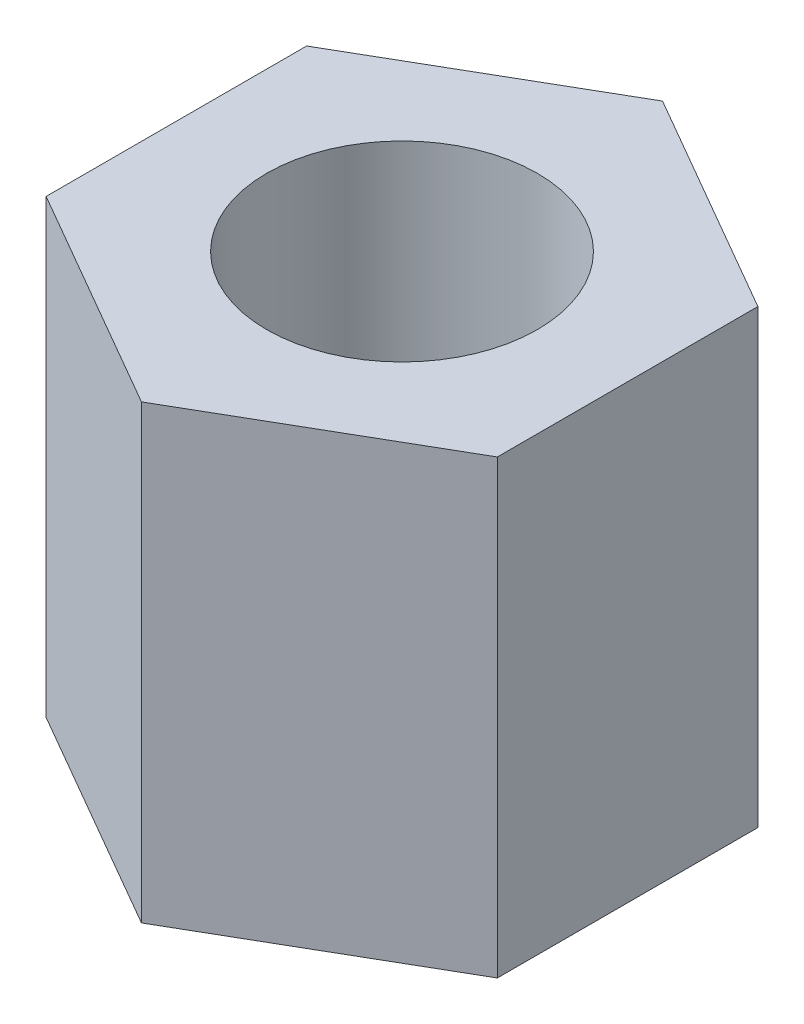
ISO-10303-21;
HEADER;
FILE_DESCRIPTION(('STEP AP214'),'2;1');
FILE_NAME('part.step','',(''),(''),'','','');
FILE_SCHEMA(('AUTOMOTIVE_DESIGN { 1 0 10303 214 1 1 1 1 }'));
ENDSEC;
DATA;
#1=APPLICATION_CONTEXT('core data for automotive mechanical design processes');
#2=APPLICATION_PROTOCOL_DEFINITION('international standard','automotive_design',2000,#1);
#3=PRODUCT_CONTEXT('',#1,'mechanical');
#4=PRODUCT('Part','Part','',(#3));
#5=PRODUCT_RELATED_PRODUCT_CATEGORY('part','',(#4));
#6=PRODUCT_DEFINITION_FORMATION('','',#4);
#7=PRODUCT_DEFINITION_CONTEXT('part definition',#1,'design');
#8=PRODUCT_DEFINITION('design','',#6,#7);
#9=PRODUCT_DEFINITION_SHAPE('','',#8);
#10=(LENGTH_UNIT() NAMED_UNIT(*) SI_UNIT(.MILLI.,.METRE.));
#11=(NAMED_UNIT(*) PLANE_ANGLE_UNIT() SI_UNIT($,.RADIAN.));
#12=(NAMED_UNIT(*) SI_UNIT($,.STERADIAN.) SOLID_ANGLE_UNIT());
#13=UNCERTAINTY_MEASURE_WITH_UNIT(LENGTH_MEASURE(1.E-05),#10,'distance_accuracy_value','');
#14=(GEOMETRIC_REPRESENTATION_CONTEXT(3) GLOBAL_UNCERTAINTY_ASSIGNED_CONTEXT((#13)) GLOBAL_UNIT_ASSIGNED_CONTEXT((#10,
#11,#12)) REPRESENTATION_CONTEXT('',''));
#15=CARTESIAN_POINT('',(0.,0.,0.));
#16=DIRECTION('',(0.,0.,1.));
#17=DIRECTION('',(1.,0.,0.));
#18=AXIS2_PLACEMENT_3D('',#15,#16,#17);
#19=CARTESIAN_POINT('',(0.,5.,0.));
#20=DIRECTION('',(0.,1.,0.));
#21=DIRECTION('',(0.,0.,1.));
#22=AXIS2_PLACEMENT_3D('',#19,#20,#21);
#23=PLANE('',#22);
#24=DIRECTION('',(-0.866025403784439,0.,-0.499999999999999));
#25=VECTOR('',#24,1.);
#26=CARTESIAN_POINT('',(-32.4518092061727,5.,-15.6504060337565));
#27=LINE('',#26,#25);
#28=CARTESIAN_POINT('',(-32.4518092061727,5.,-15.6504060337565));
#29=VERTEX_POINT('',#28);
#30=CARTESIAN_POINT('',(-34.9518092061727,5.,-17.0937817067306));
#31=VERTEX_POINT('',#30);
#32=EDGE_CURVE('E129',#29,#31,#27,.T.);
#33=ORIENTED_EDGE('',*,*,#32,.T.);
#34=DIRECTION('',(-0.866025403784438,0.,0.500000000000001));
#35=VECTOR('',#34,1.);
#36=CARTESIAN_POINT('',(-34.9518092061727,5.,-17.0937817067306));
#37=LINE('',#36,#35);
#38=CARTESIAN_POINT('',(-37.4518092061727,5.,-15.6504060337565));
#39=VERTEX_POINT('',#38);
#40=EDGE_CURVE('E87',#31,#39,#37,.T.);
#41=ORIENTED_EDGE('',*,*,#40,.T.);
#42=DIRECTION('',(0.,0.,1.));
#43=VECTOR('',#42,1.);
#44=CARTESIAN_POINT('',(-37.4518092061727,5.,-15.6504060337565));
#45=LINE('',#44,#43);
#46=CARTESIAN_POINT('',(-37.4518092061727,5.,-12.7636546878084));
#47=VERTEX_POINT('',#46);
#48=EDGE_CURVE('E100',#39,#47,#45,.T.);
#49=ORIENTED_EDGE('',*,*,#48,.T.);
#50=DIRECTION('',(0.866025403784439,0.,0.5));
#51=VECTOR('',#50,1.);
#52=CARTESIAN_POINT('',(-37.4518092061727,5.,-12.7636546878084));
#53=LINE('',#52,#51);
#54=CARTESIAN_POINT('',(-34.9518092061727,5.,-11.3202790148343));
#55=VERTEX_POINT('',#54);
#56=EDGE_CURVE('E94',#47,#55,#53,.T.);
#57=ORIENTED_EDGE('',*,*,#56,.T.);
#58=DIRECTION('',(0.866025403784439,0.,-0.5));
#59=VECTOR('',#58,1.);
#60=CARTESIAN_POINT('',(-34.9518092061727,5.,-11.3202790148343));
#61=LINE('',#60,#59);
#62=CARTESIAN_POINT('',(-32.4518092061727,5.,-12.7636546878084));
#63=VERTEX_POINT('',#62);
#64=EDGE_CURVE('E98',#55,#63,#61,.T.);
#65=ORIENTED_EDGE('',*,*,#64,.T.);
#66=DIRECTION('',(0.,0.,-1.));
#67=VECTOR('',#66,1.);
#68=CARTESIAN_POINT('',(-32.4518092061727,5.,-12.7636546878084));
#69=LINE('',#68,#67);
#70=EDGE_CURVE('E50',#63,#29,#69,.T.);
#71=ORIENTED_EDGE('',*,*,#70,.T.);
#72=EDGE_LOOP('',(#33,#41,#49,#57,#65,#71));
#73=FACE_BOUND('',#72,.T.);
#74=CARTESIAN_POINT('',(-34.9518092061727,5.,-14.2070303607825));
#75=DIRECTION('',(0.,1.,0.));
#76=DIRECTION('',(0.,0.,1.));
#77=AXIS2_PLACEMENT_3D('',#74,#75,#76);
#78=CIRCLE('',#77,1.5);
#79=CARTESIAN_POINT('',(-34.9518092061727,5.,-12.7070303607825));
#80=VERTEX_POINT('',#79);
#81=EDGE_CURVE('E122',#80,#80,#78,.T.);
#82=ORIENTED_EDGE('',*,*,#81,.F.);
#83=EDGE_LOOP('',(#82));
#84=FACE_BOUND('',#83,.T.);
#85=ADVANCED_FACE('F33',(#73,#84),#23,.T.);
#86=CARTESIAN_POINT('',(0.,0.,0.));
#87=DIRECTION('',(0.,1.,0.));
#88=DIRECTION('',(0.,0.,1.));
#89=AXIS2_PLACEMENT_3D('',#86,#87,#88);
#90=PLANE('',#89);
#91=DIRECTION('',(-0.866025403784439,0.,-0.499999999999999));
#92=VECTOR('',#91,1.);
#93=CARTESIAN_POINT('',(-32.4518092061727,0.,-15.6504060337565));
#94=LINE('',#93,#92);
#95=CARTESIAN_POINT('',(-32.4518092061727,0.,-15.6504060337565));
#96=VERTEX_POINT('',#95);
#97=CARTESIAN_POINT('',(-34.9518092061727,0.,-17.0937817067306));
#98=VERTEX_POINT('',#97);
#99=EDGE_CURVE('E118',#96,#98,#94,.T.);
#100=ORIENTED_EDGE('',*,*,#99,.F.);
#101=DIRECTION('',(0.,0.,-1.));
#102=VECTOR('',#101,1.);
#103=CARTESIAN_POINT('',(-32.4518092061727,0.,-12.7636546878084));
#104=LINE('',#103,#102);
#105=CARTESIAN_POINT('',(-32.4518092061727,0.,-12.7636546878084));
#106=VERTEX_POINT('',#105);
#107=EDGE_CURVE('E79',#106,#96,#104,.T.);
#108=ORIENTED_EDGE('',*,*,#107,.F.);
#109=DIRECTION('',(0.866025403784439,0.,-0.5));
#110=VECTOR('',#109,1.);
#111=CARTESIAN_POINT('',(-34.9518092061727,0.,-11.3202790148343));
#112=LINE('',#111,#110);
#113=CARTESIAN_POINT('',(-34.9518092061727,0.,-11.3202790148343));
#114=VERTEX_POINT('',#113);
#115=EDGE_CURVE('E73',#114,#106,#112,.T.);
#116=ORIENTED_EDGE('',*,*,#115,.F.);
#117=DIRECTION('',(0.866025403784439,0.,0.5));
#118=VECTOR('',#117,1.);
#119=CARTESIAN_POINT('',(-37.4518092061727,0.,-12.7636546878084));
#120=LINE('',#119,#118);
#121=CARTESIAN_POINT('',(-37.4518092061727,0.,-12.7636546878084));
#122=VERTEX_POINT('',#121);
#123=EDGE_CURVE('E108',#122,#114,#120,.T.);
#124=ORIENTED_EDGE('',*,*,#123,.F.);
#125=DIRECTION('',(0.,0.,1.));
#126=VECTOR('',#125,1.);
#127=CARTESIAN_POINT('',(-37.4518092061727,0.,-15.6504060337565));
#128=LINE('',#127,#126);
#129=CARTESIAN_POINT('',(-37.4518092061727,0.,-15.6504060337565));
#130=VERTEX_POINT('',#129);
#131=EDGE_CURVE('E124',#130,#122,#128,.T.);
#132=ORIENTED_EDGE('',*,*,#131,.F.);
#133=DIRECTION('',(-0.866025403784438,0.,0.500000000000001));
#134=VECTOR('',#133,1.);
#135=CARTESIAN_POINT('',(-34.9518092061727,0.,-17.0937817067306));
#136=LINE('',#135,#134);
#137=EDGE_CURVE('E121',#98,#130,#136,.T.);
#138=ORIENTED_EDGE('',*,*,#137,.F.);
#139=EDGE_LOOP('',(#100,#108,#116,#124,#132,#138));
#140=FACE_BOUND('',#139,.T.);
#141=CARTESIAN_POINT('',(-34.9518092061727,0.,-14.2070303607825));
#142=DIRECTION('',(0.,1.,0.));
#143=DIRECTION('',(0.,0.,1.));
#144=AXIS2_PLACEMENT_3D('',#141,#142,#143);
#145=CIRCLE('',#144,1.5);
#146=CARTESIAN_POINT('',(-34.9518092061727,0.,-12.7070303607825));
#147=VERTEX_POINT('',#146);
#148=EDGE_CURVE('E222',#147,#147,#145,.T.);
#149=ORIENTED_EDGE('',*,*,#148,.T.);
#150=EDGE_LOOP('',(#149));
#151=FACE_BOUND('',#150,.T.);
#152=ADVANCED_FACE('F138',(#140,#151),#90,.F.);
#153=CARTESIAN_POINT('',(-32.4518092061727,5.,-15.6504060337565));
#154=DIRECTION('',(-0.499999999999999,0.,0.866025403784439));
#155=DIRECTION('',(0.866025403784439,0.,0.499999999999999));
#156=AXIS2_PLACEMENT_3D('',#153,#154,#155);
#157=PLANE('',#156);
#158=ORIENTED_EDGE('',*,*,#99,.T.);
#159=DIRECTION('',(0.,-1.,0.));
#160=VECTOR('',#159,1.);
#161=CARTESIAN_POINT('',(-34.9518092061727,5.,-17.0937817067306));
#162=LINE('',#161,#160);
#163=EDGE_CURVE('E11',#31,#98,#162,.T.);
#164=ORIENTED_EDGE('',*,*,#163,.F.);
#165=ORIENTED_EDGE('',*,*,#32,.F.);
#166=DIRECTION('',(0.,-1.,0.));
#167=VECTOR('',#166,1.);
#168=CARTESIAN_POINT('',(-32.4518092061727,5.,-15.6504060337565));
#169=LINE('',#168,#167);
#170=EDGE_CURVE('E114',#29,#96,#169,.T.);
#171=ORIENTED_EDGE('',*,*,#170,.T.);
#172=EDGE_LOOP('',(#158,#164,#165,#171));
#173=FACE_BOUND('',#172,.T.);
#174=ADVANCED_FACE('F35',(#173),#157,.F.);
#175=CARTESIAN_POINT('',(-34.9518092061727,5.,-17.0937817067306));
#176=DIRECTION('',(0.500000000000001,0.,0.866025403784438));
#177=DIRECTION('',(0.866025403784438,0.,-0.500000000000001));
#178=AXIS2_PLACEMENT_3D('',#175,#176,#177);
#179=PLANE('',#178);
#180=ORIENTED_EDGE('',*,*,#137,.T.);
#181=DIRECTION('',(0.,-1.,0.));
#182=VECTOR('',#181,1.);
#183=CARTESIAN_POINT('',(-37.4518092061727,5.,-15.6504060337565));
#184=LINE('',#183,#182);
#185=EDGE_CURVE('E42',#39,#130,#184,.T.);
#186=ORIENTED_EDGE('',*,*,#185,.F.);
#187=ORIENTED_EDGE('',*,*,#40,.F.);
#188=ORIENTED_EDGE('',*,*,#163,.T.);
#189=EDGE_LOOP('',(#180,#186,#187,#188));
#190=FACE_BOUND('',#189,.T.);
#191=ADVANCED_FACE('F163',(#190),#179,.F.);
#192=CARTESIAN_POINT('',(-37.4518092061727,5.,-15.6504060337565));
#193=DIRECTION('',(1.,0.,0.));
#194=DIRECTION('',(0.,0.,-1.));
#195=AXIS2_PLACEMENT_3D('',#192,#193,#194);
#196=PLANE('',#195);
#197=ORIENTED_EDGE('',*,*,#131,.T.);
#198=DIRECTION('',(0.,-1.,0.));
#199=VECTOR('',#198,1.);
#200=CARTESIAN_POINT('',(-37.4518092061727,5.,-12.7636546878084));
#201=LINE('',#200,#199);
#202=EDGE_CURVE('E109',#47,#122,#201,.T.);
#203=ORIENTED_EDGE('',*,*,#202,.F.);
#204=ORIENTED_EDGE('',*,*,#48,.F.);
#205=ORIENTED_EDGE('',*,*,#185,.T.);
#206=EDGE_LOOP('',(#197,#203,#204,#205));
#207=FACE_BOUND('',#206,.T.);
#208=ADVANCED_FACE('F135',(#207),#196,.F.);
#209=CARTESIAN_POINT('',(-37.4518092061727,5.,-12.7636546878084));
#210=DIRECTION('',(0.5,0.,-0.866025403784439));
#211=DIRECTION('',(-0.866025403784439,0.,-0.5));
#212=AXIS2_PLACEMENT_3D('',#209,#210,#211);
#213=PLANE('',#212);
#214=ORIENTED_EDGE('',*,*,#123,.T.);
#215=DIRECTION('',(0.,-1.,0.));
#216=VECTOR('',#215,1.);
#217=CARTESIAN_POINT('',(-34.9518092061727,5.,-11.3202790148343));
#218=LINE('',#217,#216);
#219=EDGE_CURVE('E105',#55,#114,#218,.T.);
#220=ORIENTED_EDGE('',*,*,#219,.F.);
#221=ORIENTED_EDGE('',*,*,#56,.F.);
#222=ORIENTED_EDGE('',*,*,#202,.T.);
#223=EDGE_LOOP('',(#214,#220,#221,#222));
#224=FACE_BOUND('',#223,.T.);
#225=ADVANCED_FACE('F106',(#224),#213,.F.);
#226=CARTESIAN_POINT('',(-34.9518092061727,5.,-11.3202790148343));
#227=DIRECTION('',(-0.5,0.,-0.866025403784439));
#228=DIRECTION('',(-0.866025403784439,0.,0.5));
#229=AXIS2_PLACEMENT_3D('',#226,#227,#228);
#230=PLANE('',#229);
#231=ORIENTED_EDGE('',*,*,#115,.T.);
#232=DIRECTION('',(0.,-1.,0.));
#233=VECTOR('',#232,1.);
#234=CARTESIAN_POINT('',(-32.4518092061727,5.,-12.7636546878084));
#235=LINE('',#234,#233);
#236=EDGE_CURVE('E110',#63,#106,#235,.T.);
#237=ORIENTED_EDGE('',*,*,#236,.F.);
#238=ORIENTED_EDGE('',*,*,#64,.F.);
#239=ORIENTED_EDGE('',*,*,#219,.T.);
#240=EDGE_LOOP('',(#231,#237,#238,#239));
#241=FACE_BOUND('',#240,.T.);
#242=ADVANCED_FACE('F112',(#241),#230,.F.);
#243=CARTESIAN_POINT('',(-32.4518092061727,5.,-12.7636546878084));
#244=DIRECTION('',(-1.,0.,0.));
#245=DIRECTION('',(0.,0.,1.));
#246=AXIS2_PLACEMENT_3D('',#243,#244,#245);
#247=PLANE('',#246);
#248=ORIENTED_EDGE('',*,*,#107,.T.);
#249=ORIENTED_EDGE('',*,*,#170,.F.);
#250=ORIENTED_EDGE('',*,*,#70,.F.);
#251=ORIENTED_EDGE('',*,*,#236,.T.);
#252=EDGE_LOOP('',(#248,#249,#250,#251));
#253=FACE_BOUND('',#252,.T.);
#254=ADVANCED_FACE('F143',(#253),#247,.F.);
#255=CARTESIAN_POINT('',(-34.9518092061727,5.,-14.2070303607825));
#256=DIRECTION('',(0.,-1.,0.));
#257=DIRECTION('',(0.,0.,-1.));
#258=AXIS2_PLACEMENT_3D('',#255,#256,#257);
#259=CYLINDRICAL_SURFACE('',#258,1.5);
#260=ORIENTED_EDGE('',*,*,#81,.T.);
#261=EDGE_LOOP('',(#260));
#262=FACE_BOUND('',#261,.T.);
#263=ORIENTED_EDGE('',*,*,#148,.F.);
#264=EDGE_LOOP('',(#263));
#265=FACE_BOUND('',#264,.T.);
#266=ADVANCED_FACE('F145',(#262,#265),#259,.F.);
#267=CLOSED_SHELL('',(#85,#152,#174,#191,#208,#225,#242,#254,#266));
#268=MANIFOLD_SOLID_BREP('B2',#267);
#269=ADVANCED_BREP_SHAPE_REPRESENTATION('',(#18,#268),#14);
#270=SHAPE_DEFINITION_REPRESENTATION(#9,#269);
ENDSEC;
END-ISO-10303-21;
